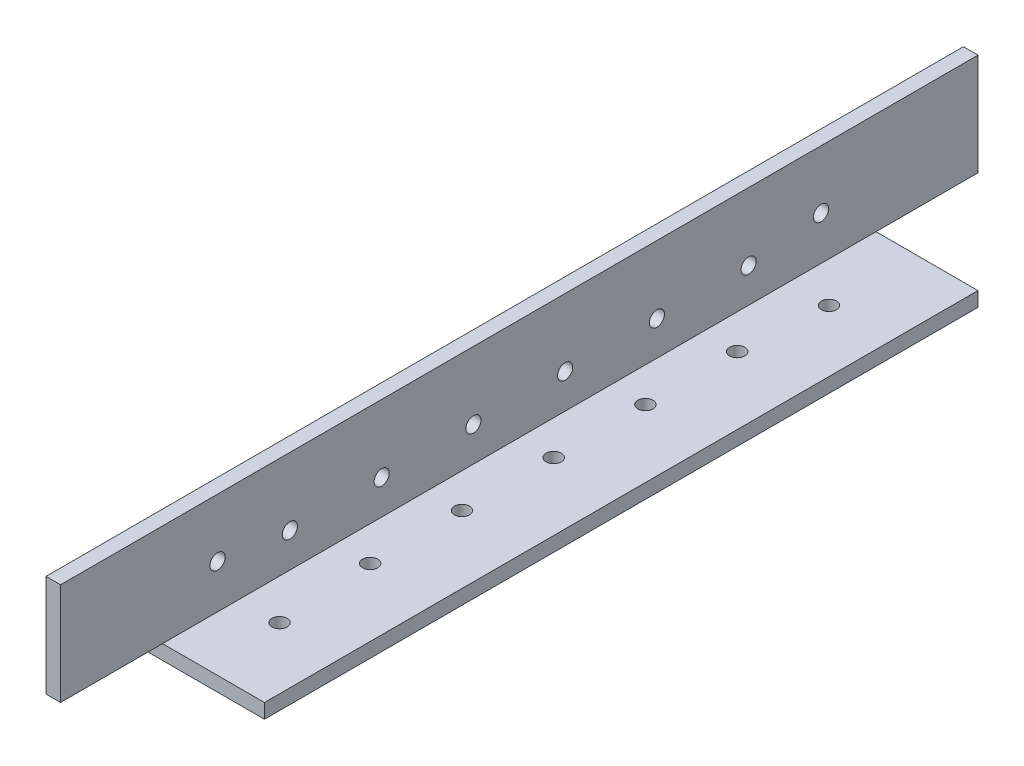
ISO-10303-21;
HEADER;
FILE_DESCRIPTION(('STEP AP214'),'2;1');
FILE_NAME('part.step','',(''),(''),'','','');
FILE_SCHEMA(('AUTOMOTIVE_DESIGN { 1 0 10303 214 1 1 1 1 }'));
ENDSEC;
DATA;
#1=APPLICATION_CONTEXT('core data for automotive mechanical design processes');
#2=APPLICATION_PROTOCOL_DEFINITION('international standard','automotive_design',2000,#1);
#3=PRODUCT_CONTEXT('',#1,'mechanical');
#4=PRODUCT('Part','Part','',(#3));
#5=PRODUCT_RELATED_PRODUCT_CATEGORY('part','',(#4));
#6=PRODUCT_DEFINITION_FORMATION('','',#4);
#7=PRODUCT_DEFINITION_CONTEXT('part definition',#1,'design');
#8=PRODUCT_DEFINITION('design','',#6,#7);
#9=PRODUCT_DEFINITION_SHAPE('','',#8);
#10=(LENGTH_UNIT() NAMED_UNIT(*) SI_UNIT(.MILLI.,.METRE.));
#11=(NAMED_UNIT(*) PLANE_ANGLE_UNIT() SI_UNIT($,.RADIAN.));
#12=(NAMED_UNIT(*) SI_UNIT($,.STERADIAN.) SOLID_ANGLE_UNIT());
#13=UNCERTAINTY_MEASURE_WITH_UNIT(LENGTH_MEASURE(1.E-05),#10,'distance_accuracy_value','');
#14=(GEOMETRIC_REPRESENTATION_CONTEXT(3) GLOBAL_UNCERTAINTY_ASSIGNED_CONTEXT((#13)) GLOBAL_UNIT_ASSIGNED_CONTEXT((#10,
#11,#12)) REPRESENTATION_CONTEXT('',''));
#15=CARTESIAN_POINT('',(0.,0.,0.));
#16=DIRECTION('',(0.,0.,1.));
#17=DIRECTION('',(1.,0.,0.));
#18=AXIS2_PLACEMENT_3D('',#15,#16,#17);
#19=CARTESIAN_POINT('',(0.,0.,1219.2));
#20=DIRECTION('',(0.,0.,1.));
#21=DIRECTION('',(1.,0.,0.));
#22=AXIS2_PLACEMENT_3D('',#19,#20,#21);
#23=PLANE('',#22);
#24=DIRECTION('',(1.,0.,0.));
#25=VECTOR('',#24,1.);
#26=CARTESIAN_POINT('',(25.4,3.175,1219.2));
#27=LINE('',#26,#25);
#28=CARTESIAN_POINT('',(0.,3.175,1219.2));
#29=VERTEX_POINT('',#28);
#30=CARTESIAN_POINT('',(3.175,3.175,1219.2));
#31=VERTEX_POINT('',#30);
#32=EDGE_CURVE('E226',#29,#31,#27,.T.);
#33=ORIENTED_EDGE('',*,*,#32,.T.);
#34=DIRECTION('',(0.,1.,0.));
#35=VECTOR('',#34,1.);
#36=CARTESIAN_POINT('',(3.175,3.175,1219.2));
#37=LINE('',#36,#35);
#38=CARTESIAN_POINT('',(3.175,25.4,1219.2));
#39=VERTEX_POINT('',#38);
#40=EDGE_CURVE('E57',#31,#39,#37,.T.);
#41=ORIENTED_EDGE('',*,*,#40,.T.);
#42=DIRECTION('',(-1.,0.,0.));
#43=VECTOR('',#42,1.);
#44=CARTESIAN_POINT('',(3.175,25.4,1219.2));
#45=LINE('',#44,#43);
#46=CARTESIAN_POINT('',(0.,25.4,1219.2));
#47=VERTEX_POINT('',#46);
#48=EDGE_CURVE('E252',#39,#47,#45,.T.);
#49=ORIENTED_EDGE('',*,*,#48,.T.);
#50=DIRECTION('',(0.,-1.,0.));
#51=VECTOR('',#50,1.);
#52=CARTESIAN_POINT('',(0.,25.4,1219.2));
#53=LINE('',#52,#51);
#54=EDGE_CURVE('E254',#47,#29,#53,.T.);
#55=ORIENTED_EDGE('',*,*,#54,.T.);
#56=EDGE_LOOP('',(#33,#41,#49,#55));
#57=FACE_BOUND('',#56,.T.);
#58=ADVANCED_FACE('F41',(#57),#23,.T.);
#59=CARTESIAN_POINT('',(60.,25.4,1019.2));
#60=DIRECTION('',(0.,0.,1.));
#61=DIRECTION('',(1.,0.,0.));
#62=AXIS2_PLACEMENT_3D('',#59,#60,#61);
#63=PLANE('',#62);
#64=DIRECTION('',(0.,1.,0.));
#65=VECTOR('',#64,1.);
#66=CARTESIAN_POINT('',(3.175,3.175,1019.2));
#67=LINE('',#66,#65);
#68=CARTESIAN_POINT('',(3.175,3.175,1019.2));
#69=VERTEX_POINT('',#68);
#70=CARTESIAN_POINT('',(3.17500000000002,25.4,1019.2));
#71=VERTEX_POINT('',#70);
#72=EDGE_CURVE('E115',#69,#71,#67,.T.);
#73=ORIENTED_EDGE('',*,*,#72,.F.);
#74=DIRECTION('',(1.,0.,0.));
#75=VECTOR('',#74,1.);
#76=CARTESIAN_POINT('',(60.,3.17500000000001,1019.2));
#77=LINE('',#76,#75);
#78=CARTESIAN_POINT('',(0.,3.175,1019.2));
#79=VERTEX_POINT('',#78);
#80=EDGE_CURVE('E50',#79,#69,#77,.T.);
#81=ORIENTED_EDGE('',*,*,#80,.F.);
#82=DIRECTION('',(0.,1.,0.));
#83=VECTOR('',#82,1.);
#84=CARTESIAN_POINT('',(0.,25.4,1019.2));
#85=LINE('',#84,#83);
#86=CARTESIAN_POINT('',(0.,25.4,1019.2));
#87=VERTEX_POINT('',#86);
#88=EDGE_CURVE('E248',#79,#87,#85,.T.);
#89=ORIENTED_EDGE('',*,*,#88,.T.);
#90=DIRECTION('',(-1.,0.,0.));
#91=VECTOR('',#90,1.);
#92=CARTESIAN_POINT('',(60.,25.4,1019.2));
#93=LINE('',#92,#91);
#94=EDGE_CURVE('E120',#71,#87,#93,.T.);
#95=ORIENTED_EDGE('',*,*,#94,.F.);
#96=EDGE_LOOP('',(#73,#81,#89,#95));
#97=FACE_BOUND('',#96,.T.);
#98=ADVANCED_FACE('F117',(#97),#63,.F.);
#99=CARTESIAN_POINT('',(3.175,3.175,1219.2));
#100=DIRECTION('',(-1.,0.,0.));
#101=DIRECTION('',(0.,-1.,0.));
#102=AXIS2_PLACEMENT_3D('',#99,#100,#101);
#103=PLANE('',#102);
#104=CARTESIAN_POINT('',(3.175,12.6999999999998,1053.42570433294));
#105=DIRECTION('',(1.,0.,0.));
#106=DIRECTION('',(0.,1.,0.));
#107=AXIS2_PLACEMENT_3D('',#104,#105,#106);
#108=CIRCLE('',#107,1.64999999999982);
#109=CARTESIAN_POINT('',(3.175,14.3499999999997,1053.42570433294));
#110=VERTEX_POINT('',#109);
#111=EDGE_CURVE('E157',#110,#110,#108,.T.);
#112=ORIENTED_EDGE('',*,*,#111,.F.);
#113=EDGE_LOOP('',(#112));
#114=FACE_BOUND('',#113,.T.);
#115=CARTESIAN_POINT('',(3.175,12.7000000000007,1184.97929566706));
#116=DIRECTION('',(1.,0.,0.));
#117=DIRECTION('',(0.,1.,0.));
#118=AXIS2_PLACEMENT_3D('',#115,#116,#117);
#119=CIRCLE('',#118,1.64999999999982);
#120=CARTESIAN_POINT('',(3.175,14.3500000000006,1184.97929566706));
#121=VERTEX_POINT('',#120);
#122=EDGE_CURVE('E163',#121,#121,#119,.T.);
#123=ORIENTED_EDGE('',*,*,#122,.F.);
#124=EDGE_LOOP('',(#123));
#125=FACE_BOUND('',#124,.T.);
#126=CARTESIAN_POINT('',(3.175,10.675,1169.2));
#127=DIRECTION('',(1.,0.,0.));
#128=DIRECTION('',(0.,1.,0.));
#129=AXIS2_PLACEMENT_3D('',#126,#127,#128);
#130=CIRCLE('',#129,1.64999999999982);
#131=CARTESIAN_POINT('',(3.175,12.3249999999998,1169.2));
#132=VERTEX_POINT('',#131);
#133=EDGE_CURVE('E142',#132,#132,#130,.T.);
#134=ORIENTED_EDGE('',*,*,#133,.F.);
#135=EDGE_LOOP('',(#134));
#136=FACE_BOUND('',#135,.T.);
#137=CARTESIAN_POINT('',(3.175,10.675,1149.2));
#138=DIRECTION('',(1.,0.,0.));
#139=DIRECTION('',(0.,1.,0.));
#140=AXIS2_PLACEMENT_3D('',#137,#138,#139);
#141=CIRCLE('',#140,1.64999999999982);
#142=CARTESIAN_POINT('',(3.175,12.3249999999998,1149.2));
#143=VERTEX_POINT('',#142);
#144=EDGE_CURVE('E205',#143,#143,#141,.T.);
#145=ORIENTED_EDGE('',*,*,#144,.F.);
#146=EDGE_LOOP('',(#145));
#147=FACE_BOUND('',#146,.T.);
#148=CARTESIAN_POINT('',(3.175,10.675,1129.2));
#149=DIRECTION('',(1.,0.,0.));
#150=DIRECTION('',(0.,1.,0.));
#151=AXIS2_PLACEMENT_3D('',#148,#149,#150);
#152=CIRCLE('',#151,1.64999999999982);
#153=CARTESIAN_POINT('',(3.175,12.3249999999998,1129.2));
#154=VERTEX_POINT('',#153);
#155=EDGE_CURVE('E208',#154,#154,#152,.T.);
#156=ORIENTED_EDGE('',*,*,#155,.F.);
#157=EDGE_LOOP('',(#156));
#158=FACE_BOUND('',#157,.T.);
#159=CARTESIAN_POINT('',(3.175,10.675,1109.2));
#160=DIRECTION('',(1.,0.,0.));
#161=DIRECTION('',(0.,1.,0.));
#162=AXIS2_PLACEMENT_3D('',#159,#160,#161);
#163=CIRCLE('',#162,1.64999999999982);
#164=CARTESIAN_POINT('',(3.175,12.3249999999998,1109.2));
#165=VERTEX_POINT('',#164);
#166=EDGE_CURVE('E211',#165,#165,#163,.T.);
#167=ORIENTED_EDGE('',*,*,#166,.F.);
#168=EDGE_LOOP('',(#167));
#169=FACE_BOUND('',#168,.T.);
#170=CARTESIAN_POINT('',(3.175,10.675,1089.2));
#171=DIRECTION('',(1.,0.,0.));
#172=DIRECTION('',(0.,1.,0.));
#173=AXIS2_PLACEMENT_3D('',#170,#171,#172);
#174=CIRCLE('',#173,1.64999999999982);
#175=CARTESIAN_POINT('',(3.175,12.3249999999998,1089.2));
#176=VERTEX_POINT('',#175);
#177=EDGE_CURVE('E214',#176,#176,#174,.T.);
#178=ORIENTED_EDGE('',*,*,#177,.F.);
#179=EDGE_LOOP('',(#178));
#180=FACE_BOUND('',#179,.T.);
#181=CARTESIAN_POINT('',(3.175,10.675,1069.2));
#182=DIRECTION('',(1.,0.,0.));
#183=DIRECTION('',(0.,1.,0.));
#184=AXIS2_PLACEMENT_3D('',#181,#182,#183);
#185=CIRCLE('',#184,1.64999999999982);
#186=CARTESIAN_POINT('',(3.175,12.3249999999998,1069.2));
#187=VERTEX_POINT('',#186);
#188=EDGE_CURVE('E202',#187,#187,#185,.T.);
#189=ORIENTED_EDGE('',*,*,#188,.F.);
#190=EDGE_LOOP('',(#189));
#191=FACE_BOUND('',#190,.T.);
#192=DIRECTION('',(0.,0.,-1.));
#193=VECTOR('',#192,1.);
#194=CARTESIAN_POINT('',(3.175,25.4,1219.2));
#195=LINE('',#194,#193);
#196=EDGE_CURVE('E132',#39,#71,#195,.T.);
#197=ORIENTED_EDGE('',*,*,#196,.F.);
#198=ORIENTED_EDGE('',*,*,#40,.F.);
#199=DIRECTION('',(0.,0.,-1.));
#200=VECTOR('',#199,1.);
#201=CARTESIAN_POINT('',(3.175,3.175,1219.2));
#202=LINE('',#201,#200);
#203=CARTESIAN_POINT('',(3.175,3.175,1196.97));
#204=VERTEX_POINT('',#203);
#205=EDGE_CURVE('E11',#31,#204,#202,.T.);
#206=ORIENTED_EDGE('',*,*,#205,.T.);
#207=DIRECTION('',(0.,0.,-1.));
#208=VECTOR('',#207,1.);
#209=CARTESIAN_POINT('',(3.175,3.175,1239.2));
#210=LINE('',#209,#208);
#211=CARTESIAN_POINT('',(3.175,3.175,1041.43));
#212=VERTEX_POINT('',#211);
#213=EDGE_CURVE('E127',#204,#212,#210,.T.);
#214=ORIENTED_EDGE('',*,*,#213,.T.);
#215=EDGE_CURVE('E125',#212,#69,#210,.T.);
#216=ORIENTED_EDGE('',*,*,#215,.T.);
#217=ORIENTED_EDGE('',*,*,#72,.T.);
#218=EDGE_LOOP('',(#197,#198,#206,#214,#216,#217));
#219=FACE_BOUND('',#218,.T.);
#220=ADVANCED_FACE('F43',(#114,#125,#136,#147,#158,#169,#180,#191,#219),#103,.F.);
#221=CARTESIAN_POINT('',(3.175,25.4,1219.2));
#222=DIRECTION('',(0.,-1.,0.));
#223=DIRECTION('',(1.,0.,0.));
#224=AXIS2_PLACEMENT_3D('',#221,#222,#223);
#225=PLANE('',#224);
#226=ORIENTED_EDGE('',*,*,#196,.T.);
#227=ORIENTED_EDGE('',*,*,#94,.T.);
#228=DIRECTION('',(0.,0.,-1.));
#229=VECTOR('',#228,1.);
#230=CARTESIAN_POINT('',(0.,25.4,1219.2));
#231=LINE('',#230,#229);
#232=EDGE_CURVE('E134',#47,#87,#231,.T.);
#233=ORIENTED_EDGE('',*,*,#232,.F.);
#234=ORIENTED_EDGE('',*,*,#48,.F.);
#235=EDGE_LOOP('',(#226,#227,#233,#234));
#236=FACE_BOUND('',#235,.T.);
#237=ADVANCED_FACE('F271',(#236),#225,.F.);
#238=CARTESIAN_POINT('',(0.,25.4,1219.2));
#239=DIRECTION('',(1.,0.,0.));
#240=DIRECTION('',(0.,1.,0.));
#241=AXIS2_PLACEMENT_3D('',#238,#239,#240);
#242=PLANE('',#241);
#243=CARTESIAN_POINT('',(0.,12.6999999999998,1053.42570433294));
#244=DIRECTION('',(1.,0.,0.));
#245=DIRECTION('',(0.,1.,0.));
#246=AXIS2_PLACEMENT_3D('',#243,#244,#245);
#247=CIRCLE('',#246,1.64999999999982);
#248=CARTESIAN_POINT('',(0.,14.3499999999997,1053.42570433294));
#249=VERTEX_POINT('',#248);
#250=EDGE_CURVE('E45',#249,#249,#247,.T.);
#251=ORIENTED_EDGE('',*,*,#250,.T.);
#252=EDGE_LOOP('',(#251));
#253=FACE_BOUND('',#252,.T.);
#254=CARTESIAN_POINT('',(0.,12.7000000000007,1184.97929566706));
#255=DIRECTION('',(1.,0.,0.));
#256=DIRECTION('',(0.,1.,0.));
#257=AXIS2_PLACEMENT_3D('',#254,#255,#256);
#258=CIRCLE('',#257,1.64999999999982);
#259=CARTESIAN_POINT('',(0.,14.3500000000006,1184.97929566706));
#260=VERTEX_POINT('',#259);
#261=EDGE_CURVE('E155',#260,#260,#258,.T.);
#262=ORIENTED_EDGE('',*,*,#261,.T.);
#263=EDGE_LOOP('',(#262));
#264=FACE_BOUND('',#263,.T.);
#265=CARTESIAN_POINT('',(0.,10.675,1169.2));
#266=DIRECTION('',(1.,0.,0.));
#267=DIRECTION('',(0.,1.,0.));
#268=AXIS2_PLACEMENT_3D('',#265,#266,#267);
#269=CIRCLE('',#268,1.64999999999982);
#270=CARTESIAN_POINT('',(0.,12.3249999999998,1169.2));
#271=VERTEX_POINT('',#270);
#272=EDGE_CURVE('E129',#271,#271,#269,.T.);
#273=ORIENTED_EDGE('',*,*,#272,.T.);
#274=EDGE_LOOP('',(#273));
#275=FACE_BOUND('',#274,.T.);
#276=CARTESIAN_POINT('',(0.,10.675,1149.2));
#277=DIRECTION('',(1.,0.,0.));
#278=DIRECTION('',(0.,1.,0.));
#279=AXIS2_PLACEMENT_3D('',#276,#277,#278);
#280=CIRCLE('',#279,1.64999999999982);
#281=CARTESIAN_POINT('',(0.,12.3249999999998,1149.2));
#282=VERTEX_POINT('',#281);
#283=EDGE_CURVE('E151',#282,#282,#280,.T.);
#284=ORIENTED_EDGE('',*,*,#283,.T.);
#285=EDGE_LOOP('',(#284));
#286=FACE_BOUND('',#285,.T.);
#287=CARTESIAN_POINT('',(0.,10.675,1129.2));
#288=DIRECTION('',(1.,0.,0.));
#289=DIRECTION('',(0.,1.,0.));
#290=AXIS2_PLACEMENT_3D('',#287,#288,#289);
#291=CIRCLE('',#290,1.64999999999982);
#292=CARTESIAN_POINT('',(0.,12.3249999999998,1129.2));
#293=VERTEX_POINT('',#292);
#294=EDGE_CURVE('E148',#293,#293,#291,.T.);
#295=ORIENTED_EDGE('',*,*,#294,.T.);
#296=EDGE_LOOP('',(#295));
#297=FACE_BOUND('',#296,.T.);
#298=CARTESIAN_POINT('',(0.,10.675,1109.2));
#299=DIRECTION('',(1.,0.,0.));
#300=DIRECTION('',(0.,1.,0.));
#301=AXIS2_PLACEMENT_3D('',#298,#299,#300);
#302=CIRCLE('',#301,1.64999999999982);
#303=CARTESIAN_POINT('',(0.,12.3249999999998,1109.2));
#304=VERTEX_POINT('',#303);
#305=EDGE_CURVE('E145',#304,#304,#302,.T.);
#306=ORIENTED_EDGE('',*,*,#305,.T.);
#307=EDGE_LOOP('',(#306));
#308=FACE_BOUND('',#307,.T.);
#309=CARTESIAN_POINT('',(0.,10.675,1089.2));
#310=DIRECTION('',(1.,0.,0.));
#311=DIRECTION('',(0.,1.,0.));
#312=AXIS2_PLACEMENT_3D('',#309,#310,#311);
#313=CIRCLE('',#312,1.64999999999982);
#314=CARTESIAN_POINT('',(0.,12.3249999999998,1089.2));
#315=VERTEX_POINT('',#314);
#316=EDGE_CURVE('E141',#315,#315,#313,.T.);
#317=ORIENTED_EDGE('',*,*,#316,.T.);
#318=EDGE_LOOP('',(#317));
#319=FACE_BOUND('',#318,.T.);
#320=CARTESIAN_POINT('',(0.,10.675,1069.2));
#321=DIRECTION('',(1.,0.,0.));
#322=DIRECTION('',(0.,1.,0.));
#323=AXIS2_PLACEMENT_3D('',#320,#321,#322);
#324=CIRCLE('',#323,1.64999999999982);
#325=CARTESIAN_POINT('',(0.,12.3249999999998,1069.2));
#326=VERTEX_POINT('',#325);
#327=EDGE_CURVE('E138',#326,#326,#324,.T.);
#328=ORIENTED_EDGE('',*,*,#327,.T.);
#329=EDGE_LOOP('',(#328));
#330=FACE_BOUND('',#329,.T.);
#331=DIRECTION('',(0.,0.,-1.));
#332=VECTOR('',#331,1.);
#333=CARTESIAN_POINT('',(0.,0.,1219.2));
#334=LINE('',#333,#332);
#335=CARTESIAN_POINT('',(0.,0.,1196.97));
#336=VERTEX_POINT('',#335);
#337=CARTESIAN_POINT('',(0.,0.,1041.43));
#338=VERTEX_POINT('',#337);
#339=EDGE_CURVE('E262',#336,#338,#334,.T.);
#340=ORIENTED_EDGE('',*,*,#339,.F.);
#341=DIRECTION('',(0.,-1.,0.));
#342=VECTOR('',#341,1.);
#343=CARTESIAN_POINT('',(0.,36.9290056882142,1196.97));
#344=LINE('',#343,#342);
#345=CARTESIAN_POINT('',(0.,3.175,1196.97));
#346=VERTEX_POINT('',#345);
#347=EDGE_CURVE('E229',#346,#336,#344,.T.);
#348=ORIENTED_EDGE('',*,*,#347,.F.);
#349=DIRECTION('',(0.,0.,1.));
#350=VECTOR('',#349,1.);
#351=CARTESIAN_POINT('',(0.,3.175,1219.2));
#352=LINE('',#351,#350);
#353=EDGE_CURVE('E219',#346,#29,#352,.T.);
#354=ORIENTED_EDGE('',*,*,#353,.T.);
#355=ORIENTED_EDGE('',*,*,#54,.F.);
#356=ORIENTED_EDGE('',*,*,#232,.T.);
#357=ORIENTED_EDGE('',*,*,#88,.F.);
#358=DIRECTION('',(0.,0.,1.));
#359=VECTOR('',#358,1.);
#360=CARTESIAN_POINT('',(0.,3.175,1019.2));
#361=LINE('',#360,#359);
#362=CARTESIAN_POINT('',(0.,3.175,1041.43));
#363=VERTEX_POINT('',#362);
#364=EDGE_CURVE('E65',#79,#363,#361,.T.);
#365=ORIENTED_EDGE('',*,*,#364,.T.);
#366=DIRECTION('',(0.,-1.,0.));
#367=VECTOR('',#366,1.);
#368=CARTESIAN_POINT('',(0.,36.9290056882142,1041.43));
#369=LINE('',#368,#367);
#370=EDGE_CURVE('E238',#363,#338,#369,.T.);
#371=ORIENTED_EDGE('',*,*,#370,.T.);
#372=EDGE_LOOP('',(#340,#348,#354,#355,#356,#357,#365,#371));
#373=FACE_BOUND('',#372,.T.);
#374=ADVANCED_FACE('F268',(#253,#264,#275,#286,#297,#308,#319,#330,#373),#242,.F.);
#375=CARTESIAN_POINT('',(0.,0.,1219.2));
#376=DIRECTION('',(0.,1.,0.));
#377=DIRECTION('',(0.,0.,1.));
#378=AXIS2_PLACEMENT_3D('',#375,#376,#377);
#379=PLANE('',#378);
#380=CARTESIAN_POINT('',(11.9634000000024,0.,1180.26062285682));
#381=DIRECTION('',(0.,1.,0.));
#382=DIRECTION('',(0.,0.,1.));
#383=AXIS2_PLACEMENT_3D('',#380,#381,#382);
#384=CIRCLE('',#383,1.65000000000001);
#385=CARTESIAN_POINT('',(11.9634000000024,0.,1181.91062285682));
#386=VERTEX_POINT('',#385);
#387=EDGE_CURVE('E168',#386,#386,#384,.T.);
#388=ORIENTED_EDGE('',*,*,#387,.T.);
#389=EDGE_LOOP('',(#388));
#390=FACE_BOUND('',#389,.T.);
#391=CARTESIAN_POINT('',(11.9634000000002,0.,1060.48));
#392=DIRECTION('',(0.,1.,0.));
#393=DIRECTION('',(0.,0.,1.));
#394=AXIS2_PLACEMENT_3D('',#391,#392,#393);
#395=CIRCLE('',#394,1.65);
#396=CARTESIAN_POINT('',(11.9634000000002,0.,1062.13));
#397=VERTEX_POINT('',#396);
#398=EDGE_CURVE('E385',#397,#397,#395,.T.);
#399=ORIENTED_EDGE('',*,*,#398,.T.);
#400=EDGE_LOOP('',(#399));
#401=FACE_BOUND('',#400,.T.);
#402=CARTESIAN_POINT('',(10.675,0.,1079.2));
#403=DIRECTION('',(0.,1.,0.));
#404=DIRECTION('',(0.,0.,1.));
#405=AXIS2_PLACEMENT_3D('',#402,#403,#404);
#406=CIRCLE('',#405,1.65000000000001);
#407=CARTESIAN_POINT('',(10.675,0.,1080.85));
#408=VERTEX_POINT('',#407);
#409=EDGE_CURVE('E199',#408,#408,#406,.T.);
#410=ORIENTED_EDGE('',*,*,#409,.T.);
#411=EDGE_LOOP('',(#410));
#412=FACE_BOUND('',#411,.T.);
#413=CARTESIAN_POINT('',(10.6750000000002,0.,1099.2));
#414=DIRECTION('',(0.,1.,0.));
#415=DIRECTION('',(0.,0.,1.));
#416=AXIS2_PLACEMENT_3D('',#413,#414,#415);
#417=CIRCLE('',#416,1.65000000000001);
#418=CARTESIAN_POINT('',(10.6750000000002,0.,1100.85));
#419=VERTEX_POINT('',#418);
#420=EDGE_CURVE('E196',#419,#419,#417,.T.);
#421=ORIENTED_EDGE('',*,*,#420,.T.);
#422=EDGE_LOOP('',(#421));
#423=FACE_BOUND('',#422,.T.);
#424=CARTESIAN_POINT('',(10.6750000000004,0.,1119.2));
#425=DIRECTION('',(0.,1.,0.));
#426=DIRECTION('',(0.,0.,1.));
#427=AXIS2_PLACEMENT_3D('',#424,#425,#426);
#428=CIRCLE('',#427,1.65000000000001);
#429=CARTESIAN_POINT('',(10.6750000000004,0.,1120.85));
#430=VERTEX_POINT('',#429);
#431=EDGE_CURVE('E193',#430,#430,#428,.T.);
#432=ORIENTED_EDGE('',*,*,#431,.T.);
#433=EDGE_LOOP('',(#432));
#434=FACE_BOUND('',#433,.T.);
#435=CARTESIAN_POINT('',(10.6750000000006,0.,1139.2));
#436=DIRECTION('',(0.,1.,0.));
#437=DIRECTION('',(0.,0.,1.));
#438=AXIS2_PLACEMENT_3D('',#435,#436,#437);
#439=CIRCLE('',#438,1.65000000000001);
#440=CARTESIAN_POINT('',(10.6750000000006,0.,1140.85));
#441=VERTEX_POINT('',#440);
#442=EDGE_CURVE('E190',#441,#441,#439,.T.);
#443=ORIENTED_EDGE('',*,*,#442,.T.);
#444=EDGE_LOOP('',(#443));
#445=FACE_BOUND('',#444,.T.);
#446=CARTESIAN_POINT('',(10.6750000000008,0.,1159.2));
#447=DIRECTION('',(0.,1.,0.));
#448=DIRECTION('',(0.,0.,1.));
#449=AXIS2_PLACEMENT_3D('',#446,#447,#448);
#450=CIRCLE('',#449,1.65000000000001);
#451=CARTESIAN_POINT('',(10.6750000000008,0.,1160.85));
#452=VERTEX_POINT('',#451);
#453=EDGE_CURVE('E176',#452,#452,#450,.T.);
#454=ORIENTED_EDGE('',*,*,#453,.T.);
#455=EDGE_LOOP('',(#454));
#456=FACE_BOUND('',#455,.T.);
#457=DIRECTION('',(0.,0.,-1.));
#458=VECTOR('',#457,1.);
#459=CARTESIAN_POINT('',(25.4,0.,1219.2));
#460=LINE('',#459,#458);
#461=CARTESIAN_POINT('',(25.4,0.,1196.97));
#462=VERTEX_POINT('',#461);
#463=CARTESIAN_POINT('',(25.4,0.,1041.43));
#464=VERTEX_POINT('',#463);
#465=EDGE_CURVE('E260',#462,#464,#460,.T.);
#466=ORIENTED_EDGE('',*,*,#465,.F.);
#467=DIRECTION('',(1.,0.,0.));
#468=VECTOR('',#467,1.);
#469=CARTESIAN_POINT('',(25.4,0.,1196.97));
#470=LINE('',#469,#468);
#471=EDGE_CURVE('E227',#336,#462,#470,.T.);
#472=ORIENTED_EDGE('',*,*,#471,.F.);
#473=ORIENTED_EDGE('',*,*,#339,.T.);
#474=DIRECTION('',(-1.,0.,0.));
#475=VECTOR('',#474,1.);
#476=CARTESIAN_POINT('',(25.4,0.,1041.43));
#477=LINE('',#476,#475);
#478=EDGE_CURVE('E235',#464,#338,#477,.T.);
#479=ORIENTED_EDGE('',*,*,#478,.F.);
#480=EDGE_LOOP('',(#466,#472,#473,#479));
#481=FACE_BOUND('',#480,.T.);
#482=ADVANCED_FACE('F283',(#390,#401,#412,#423,#434,#445,#456,#481),#379,.F.);
#483=CARTESIAN_POINT('',(25.4,0.,1219.2));
#484=DIRECTION('',(-1.,0.,0.));
#485=DIRECTION('',(0.,0.,1.));
#486=AXIS2_PLACEMENT_3D('',#483,#484,#485);
#487=PLANE('',#486);
#488=DIRECTION('',(0.,0.,-1.));
#489=VECTOR('',#488,1.);
#490=CARTESIAN_POINT('',(25.4,3.175,1219.2));
#491=LINE('',#490,#489);
#492=CARTESIAN_POINT('',(25.4,3.175,1196.97));
#493=VERTEX_POINT('',#492);
#494=CARTESIAN_POINT('',(25.4,3.175,1041.43));
#495=VERTEX_POINT('',#494);
#496=EDGE_CURVE('E257',#493,#495,#491,.T.);
#497=ORIENTED_EDGE('',*,*,#496,.F.);
#498=DIRECTION('',(0.,-1.,0.));
#499=VECTOR('',#498,1.);
#500=CARTESIAN_POINT('',(25.4,36.9290056882142,1196.97));
#501=LINE('',#500,#499);
#502=EDGE_CURVE('E223',#493,#462,#501,.T.);
#503=ORIENTED_EDGE('',*,*,#502,.T.);
#504=ORIENTED_EDGE('',*,*,#465,.T.);
#505=DIRECTION('',(0.,-1.,0.));
#506=VECTOR('',#505,1.);
#507=CARTESIAN_POINT('',(25.4,36.9290056882142,1041.43));
#508=LINE('',#507,#506);
#509=EDGE_CURVE('E241',#495,#464,#508,.T.);
#510=ORIENTED_EDGE('',*,*,#509,.F.);
#511=EDGE_LOOP('',(#497,#503,#504,#510));
#512=FACE_BOUND('',#511,.T.);
#513=ADVANCED_FACE('F288',(#512),#487,.F.);
#514=CARTESIAN_POINT('',(25.4,3.175,1219.2));
#515=DIRECTION('',(0.,-1.,0.));
#516=DIRECTION('',(1.,0.,0.));
#517=AXIS2_PLACEMENT_3D('',#514,#515,#516);
#518=PLANE('',#517);
#519=CARTESIAN_POINT('',(11.9634000000024,3.175,1180.26062285682));
#520=DIRECTION('',(0.,1.,0.));
#521=DIRECTION('',(-1.,0.,0.));
#522=AXIS2_PLACEMENT_3D('',#519,#520,#521);
#523=CIRCLE('',#522,1.65000000000001);
#524=CARTESIAN_POINT('',(10.3134000000024,3.175,1180.26062285682));
#525=VERTEX_POINT('',#524);
#526=EDGE_CURVE('E381',#525,#525,#523,.T.);
#527=ORIENTED_EDGE('',*,*,#526,.F.);
#528=EDGE_LOOP('',(#527));
#529=FACE_BOUND('',#528,.T.);
#530=CARTESIAN_POINT('',(11.9634000000002,3.175,1060.48));
#531=DIRECTION('',(0.,1.,0.));
#532=DIRECTION('',(-1.,0.,0.));
#533=AXIS2_PLACEMENT_3D('',#530,#531,#532);
#534=CIRCLE('',#533,1.65);
#535=CARTESIAN_POINT('',(10.3134000000002,3.175,1060.48));
#536=VERTEX_POINT('',#535);
#537=EDGE_CURVE('E389',#536,#536,#534,.T.);
#538=ORIENTED_EDGE('',*,*,#537,.F.);
#539=EDGE_LOOP('',(#538));
#540=FACE_BOUND('',#539,.T.);
#541=CARTESIAN_POINT('',(10.675,3.175,1079.2));
#542=DIRECTION('',(0.,1.,0.));
#543=DIRECTION('',(-1.,0.,0.));
#544=AXIS2_PLACEMENT_3D('',#541,#542,#543);
#545=CIRCLE('',#544,1.65000000000001);
#546=CARTESIAN_POINT('',(9.02499999999999,3.175,1079.2));
#547=VERTEX_POINT('',#546);
#548=EDGE_CURVE('E173',#547,#547,#545,.T.);
#549=ORIENTED_EDGE('',*,*,#548,.F.);
#550=EDGE_LOOP('',(#549));
#551=FACE_BOUND('',#550,.T.);
#552=CARTESIAN_POINT('',(10.6750000000002,3.175,1099.2));
#553=DIRECTION('',(0.,1.,0.));
#554=DIRECTION('',(-1.,0.,0.));
#555=AXIS2_PLACEMENT_3D('',#552,#553,#554);
#556=CIRCLE('',#555,1.65000000000001);
#557=CARTESIAN_POINT('',(9.0250000000002,3.175,1099.2));
#558=VERTEX_POINT('',#557);
#559=EDGE_CURVE('E177',#558,#558,#556,.T.);
#560=ORIENTED_EDGE('',*,*,#559,.F.);
#561=EDGE_LOOP('',(#560));
#562=FACE_BOUND('',#561,.T.);
#563=CARTESIAN_POINT('',(10.6750000000004,3.175,1119.2));
#564=DIRECTION('',(0.,1.,0.));
#565=DIRECTION('',(-1.,0.,0.));
#566=AXIS2_PLACEMENT_3D('',#563,#564,#565);
#567=CIRCLE('',#566,1.65000000000001);
#568=CARTESIAN_POINT('',(9.02500000000041,3.175,1119.2));
#569=VERTEX_POINT('',#568);
#570=EDGE_CURVE('E180',#569,#569,#567,.T.);
#571=ORIENTED_EDGE('',*,*,#570,.F.);
#572=EDGE_LOOP('',(#571));
#573=FACE_BOUND('',#572,.T.);
#574=CARTESIAN_POINT('',(10.6750000000006,3.175,1139.2));
#575=DIRECTION('',(0.,1.,0.));
#576=DIRECTION('',(-1.,0.,0.));
#577=AXIS2_PLACEMENT_3D('',#574,#575,#576);
#578=CIRCLE('',#577,1.65000000000001);
#579=CARTESIAN_POINT('',(9.02500000000062,3.175,1139.2));
#580=VERTEX_POINT('',#579);
#581=EDGE_CURVE('E183',#580,#580,#578,.T.);
#582=ORIENTED_EDGE('',*,*,#581,.F.);
#583=EDGE_LOOP('',(#582));
#584=FACE_BOUND('',#583,.T.);
#585=CARTESIAN_POINT('',(10.6750000000008,3.175,1159.2));
#586=DIRECTION('',(0.,1.,0.));
#587=DIRECTION('',(-1.,0.,0.));
#588=AXIS2_PLACEMENT_3D('',#585,#586,#587);
#589=CIRCLE('',#588,1.65000000000001);
#590=CARTESIAN_POINT('',(9.02500000000083,3.175,1159.2));
#591=VERTEX_POINT('',#590);
#592=EDGE_CURVE('E161',#591,#591,#589,.T.);
#593=ORIENTED_EDGE('',*,*,#592,.F.);
#594=EDGE_LOOP('',(#593));
#595=FACE_BOUND('',#594,.T.);
#596=ORIENTED_EDGE('',*,*,#496,.T.);
#597=DIRECTION('',(1.,0.,0.));
#598=VECTOR('',#597,1.);
#599=CARTESIAN_POINT('',(25.4,3.175,1041.43));
#600=LINE('',#599,#598);
#601=EDGE_CURVE('E237',#212,#495,#600,.T.);
#602=ORIENTED_EDGE('',*,*,#601,.F.);
#603=ORIENTED_EDGE('',*,*,#213,.F.);
#604=DIRECTION('',(-1.,0.,0.));
#605=VECTOR('',#604,1.);
#606=CARTESIAN_POINT('',(25.4,3.175,1196.97));
#607=LINE('',#606,#605);
#608=EDGE_CURVE('E224',#493,#204,#607,.T.);
#609=ORIENTED_EDGE('',*,*,#608,.F.);
#610=EDGE_LOOP('',(#596,#602,#603,#609));
#611=FACE_BOUND('',#610,.T.);
#612=ADVANCED_FACE('F293',(#529,#540,#551,#562,#573,#584,#595,#611),#518,.F.);
#613=CARTESIAN_POINT('',(25.4,36.9290056882142,1041.43));
#614=DIRECTION('',(0.,0.,1.));
#615=DIRECTION('',(1.,0.,0.));
#616=AXIS2_PLACEMENT_3D('',#613,#614,#615);
#617=PLANE('',#616);
#618=EDGE_CURVE('E246',#363,#212,#600,.T.);
#619=ORIENTED_EDGE('',*,*,#618,.T.);
#620=ORIENTED_EDGE('',*,*,#601,.T.);
#621=ORIENTED_EDGE('',*,*,#509,.T.);
#622=ORIENTED_EDGE('',*,*,#478,.T.);
#623=ORIENTED_EDGE('',*,*,#370,.F.);
#624=EDGE_LOOP('',(#619,#620,#621,#622,#623));
#625=FACE_BOUND('',#624,.T.);
#626=ADVANCED_FACE('F290',(#625),#617,.F.);
#627=CARTESIAN_POINT('',(25.4,3.175,1219.2));
#628=DIRECTION('',(0.,-1.,0.));
#629=DIRECTION('',(1.,0.,0.));
#630=AXIS2_PLACEMENT_3D('',#627,#628,#629);
#631=PLANE('',#630);
#632=ORIENTED_EDGE('',*,*,#215,.F.);
#633=ORIENTED_EDGE('',*,*,#618,.F.);
#634=ORIENTED_EDGE('',*,*,#364,.F.);
#635=ORIENTED_EDGE('',*,*,#80,.T.);
#636=EDGE_LOOP('',(#632,#633,#634,#635));
#637=FACE_BOUND('',#636,.T.);
#638=ADVANCED_FACE('F131',(#637),#631,.T.);
#639=CARTESIAN_POINT('',(25.4,36.9290056882142,1196.97));
#640=DIRECTION('',(0.,0.,-1.));
#641=DIRECTION('',(-1.,0.,0.));
#642=AXIS2_PLACEMENT_3D('',#639,#640,#641);
#643=PLANE('',#642);
#644=ORIENTED_EDGE('',*,*,#608,.T.);
#645=EDGE_CURVE('E222',#204,#346,#607,.T.);
#646=ORIENTED_EDGE('',*,*,#645,.T.);
#647=ORIENTED_EDGE('',*,*,#347,.T.);
#648=ORIENTED_EDGE('',*,*,#471,.T.);
#649=ORIENTED_EDGE('',*,*,#502,.F.);
#650=EDGE_LOOP('',(#644,#646,#647,#648,#649));
#651=FACE_BOUND('',#650,.T.);
#652=ADVANCED_FACE('F280',(#651),#643,.F.);
#653=CARTESIAN_POINT('',(25.4,3.175,1219.2));
#654=DIRECTION('',(0.,-1.,0.));
#655=DIRECTION('',(1.,0.,0.));
#656=AXIS2_PLACEMENT_3D('',#653,#654,#655);
#657=PLANE('',#656);
#658=ORIENTED_EDGE('',*,*,#205,.F.);
#659=ORIENTED_EDGE('',*,*,#32,.F.);
#660=ORIENTED_EDGE('',*,*,#353,.F.);
#661=ORIENTED_EDGE('',*,*,#645,.F.);
#662=EDGE_LOOP('',(#658,#659,#660,#661));
#663=FACE_BOUND('',#662,.T.);
#664=ADVANCED_FACE('F275',(#663),#657,.T.);
#665=CARTESIAN_POINT('',(-16.825,10.675,1069.2));
#666=DIRECTION('',(1.,0.,0.));
#667=DIRECTION('',(0.,1.,0.));
#668=AXIS2_PLACEMENT_3D('',#665,#666,#667);
#669=CYLINDRICAL_SURFACE('',#668,1.64999999999982);
#670=ORIENTED_EDGE('',*,*,#188,.T.);
#671=EDGE_LOOP('',(#670));
#672=FACE_BOUND('',#671,.T.);
#673=ORIENTED_EDGE('',*,*,#327,.F.);
#674=EDGE_LOOP('',(#673));
#675=FACE_BOUND('',#674,.T.);
#676=ADVANCED_FACE('F320',(#672,#675),#669,.F.);
#677=CARTESIAN_POINT('',(-16.825,10.675,1089.2));
#678=DIRECTION('',(1.,0.,0.));
#679=DIRECTION('',(0.,1.,0.));
#680=AXIS2_PLACEMENT_3D('',#677,#678,#679);
#681=CYLINDRICAL_SURFACE('',#680,1.64999999999982);
#682=ORIENTED_EDGE('',*,*,#177,.T.);
#683=EDGE_LOOP('',(#682));
#684=FACE_BOUND('',#683,.T.);
#685=ORIENTED_EDGE('',*,*,#316,.F.);
#686=EDGE_LOOP('',(#685));
#687=FACE_BOUND('',#686,.T.);
#688=ADVANCED_FACE('F323',(#684,#687),#681,.F.);
#689=CARTESIAN_POINT('',(-16.825,10.675,1109.2));
#690=DIRECTION('',(1.,0.,0.));
#691=DIRECTION('',(0.,1.,0.));
#692=AXIS2_PLACEMENT_3D('',#689,#690,#691);
#693=CYLINDRICAL_SURFACE('',#692,1.64999999999982);
#694=ORIENTED_EDGE('',*,*,#166,.T.);
#695=EDGE_LOOP('',(#694));
#696=FACE_BOUND('',#695,.T.);
#697=ORIENTED_EDGE('',*,*,#305,.F.);
#698=EDGE_LOOP('',(#697));
#699=FACE_BOUND('',#698,.T.);
#700=ADVANCED_FACE('F327',(#696,#699),#693,.F.);
#701=CARTESIAN_POINT('',(-16.825,10.675,1129.2));
#702=DIRECTION('',(1.,0.,0.));
#703=DIRECTION('',(0.,1.,0.));
#704=AXIS2_PLACEMENT_3D('',#701,#702,#703);
#705=CYLINDRICAL_SURFACE('',#704,1.64999999999982);
#706=ORIENTED_EDGE('',*,*,#155,.T.);
#707=EDGE_LOOP('',(#706));
#708=FACE_BOUND('',#707,.T.);
#709=ORIENTED_EDGE('',*,*,#294,.F.);
#710=EDGE_LOOP('',(#709));
#711=FACE_BOUND('',#710,.T.);
#712=ADVANCED_FACE('F331',(#708,#711),#705,.F.);
#713=CARTESIAN_POINT('',(-16.825,10.675,1149.2));
#714=DIRECTION('',(1.,0.,0.));
#715=DIRECTION('',(0.,1.,0.));
#716=AXIS2_PLACEMENT_3D('',#713,#714,#715);
#717=CYLINDRICAL_SURFACE('',#716,1.64999999999982);
#718=ORIENTED_EDGE('',*,*,#144,.T.);
#719=EDGE_LOOP('',(#718));
#720=FACE_BOUND('',#719,.T.);
#721=ORIENTED_EDGE('',*,*,#283,.F.);
#722=EDGE_LOOP('',(#721));
#723=FACE_BOUND('',#722,.T.);
#724=ADVANCED_FACE('F335',(#720,#723),#717,.F.);
#725=CARTESIAN_POINT('',(-16.825,10.675,1169.2));
#726=DIRECTION('',(1.,0.,0.));
#727=DIRECTION('',(0.,1.,0.));
#728=AXIS2_PLACEMENT_3D('',#725,#726,#727);
#729=CYLINDRICAL_SURFACE('',#728,1.64999999999982);
#730=ORIENTED_EDGE('',*,*,#133,.T.);
#731=EDGE_LOOP('',(#730));
#732=FACE_BOUND('',#731,.T.);
#733=ORIENTED_EDGE('',*,*,#272,.F.);
#734=EDGE_LOOP('',(#733));
#735=FACE_BOUND('',#734,.T.);
#736=ADVANCED_FACE('F339',(#732,#735),#729,.F.);
#737=CARTESIAN_POINT('',(10.6750000000008,-16.825,1159.2));
#738=DIRECTION('',(0.,1.,0.));
#739=DIRECTION('',(-1.,0.,0.));
#740=AXIS2_PLACEMENT_3D('',#737,#738,#739);
#741=CYLINDRICAL_SURFACE('',#740,1.65000000000001);
#742=ORIENTED_EDGE('',*,*,#592,.T.);
#743=EDGE_LOOP('',(#742));
#744=FACE_BOUND('',#743,.T.);
#745=ORIENTED_EDGE('',*,*,#453,.F.);
#746=EDGE_LOOP('',(#745));
#747=FACE_BOUND('',#746,.T.);
#748=ADVANCED_FACE('F343',(#744,#747),#741,.F.);
#749=CARTESIAN_POINT('',(10.6750000000006,-16.825,1139.2));
#750=DIRECTION('',(0.,1.,0.));
#751=DIRECTION('',(-1.,0.,0.));
#752=AXIS2_PLACEMENT_3D('',#749,#750,#751);
#753=CYLINDRICAL_SURFACE('',#752,1.65000000000001);
#754=ORIENTED_EDGE('',*,*,#581,.T.);
#755=EDGE_LOOP('',(#754));
#756=FACE_BOUND('',#755,.T.);
#757=ORIENTED_EDGE('',*,*,#442,.F.);
#758=EDGE_LOOP('',(#757));
#759=FACE_BOUND('',#758,.T.);
#760=ADVANCED_FACE('F347',(#756,#759),#753,.F.);
#761=CARTESIAN_POINT('',(10.6750000000004,-16.825,1119.2));
#762=DIRECTION('',(0.,1.,0.));
#763=DIRECTION('',(-1.,0.,0.));
#764=AXIS2_PLACEMENT_3D('',#761,#762,#763);
#765=CYLINDRICAL_SURFACE('',#764,1.65000000000001);
#766=ORIENTED_EDGE('',*,*,#570,.T.);
#767=EDGE_LOOP('',(#766));
#768=FACE_BOUND('',#767,.T.);
#769=ORIENTED_EDGE('',*,*,#431,.F.);
#770=EDGE_LOOP('',(#769));
#771=FACE_BOUND('',#770,.T.);
#772=ADVANCED_FACE('F351',(#768,#771),#765,.F.);
#773=CARTESIAN_POINT('',(10.6750000000002,-16.825,1099.2));
#774=DIRECTION('',(0.,1.,0.));
#775=DIRECTION('',(-1.,0.,0.));
#776=AXIS2_PLACEMENT_3D('',#773,#774,#775);
#777=CYLINDRICAL_SURFACE('',#776,1.65000000000001);
#778=ORIENTED_EDGE('',*,*,#559,.T.);
#779=EDGE_LOOP('',(#778));
#780=FACE_BOUND('',#779,.T.);
#781=ORIENTED_EDGE('',*,*,#420,.F.);
#782=EDGE_LOOP('',(#781));
#783=FACE_BOUND('',#782,.T.);
#784=ADVANCED_FACE('F355',(#780,#783),#777,.F.);
#785=CARTESIAN_POINT('',(10.675,-16.825,1079.2));
#786=DIRECTION('',(0.,1.,0.));
#787=DIRECTION('',(-1.,0.,0.));
#788=AXIS2_PLACEMENT_3D('',#785,#786,#787);
#789=CYLINDRICAL_SURFACE('',#788,1.65000000000001);
#790=ORIENTED_EDGE('',*,*,#548,.T.);
#791=EDGE_LOOP('',(#790));
#792=FACE_BOUND('',#791,.T.);
#793=ORIENTED_EDGE('',*,*,#409,.F.);
#794=EDGE_LOOP('',(#793));
#795=FACE_BOUND('',#794,.T.);
#796=ADVANCED_FACE('F359',(#792,#795),#789,.F.);
#797=CARTESIAN_POINT('',(-66.825,12.7000000000007,1184.97929566706));
#798=DIRECTION('',(1.,0.,0.));
#799=DIRECTION('',(0.,1.,0.));
#800=AXIS2_PLACEMENT_3D('',#797,#798,#799);
#801=CYLINDRICAL_SURFACE('',#800,1.64999999999982);
#802=ORIENTED_EDGE('',*,*,#122,.T.);
#803=EDGE_LOOP('',(#802));
#804=FACE_BOUND('',#803,.T.);
#805=ORIENTED_EDGE('',*,*,#261,.F.);
#806=EDGE_LOOP('',(#805));
#807=FACE_BOUND('',#806,.T.);
#808=ADVANCED_FACE('F363',(#804,#807),#801,.F.);
#809=CARTESIAN_POINT('',(-66.825,12.6999999999998,1053.42570433294));
#810=DIRECTION('',(1.,0.,0.));
#811=DIRECTION('',(0.,1.,0.));
#812=AXIS2_PLACEMENT_3D('',#809,#810,#811);
#813=CYLINDRICAL_SURFACE('',#812,1.64999999999982);
#814=ORIENTED_EDGE('',*,*,#111,.T.);
#815=EDGE_LOOP('',(#814));
#816=FACE_BOUND('',#815,.T.);
#817=ORIENTED_EDGE('',*,*,#250,.F.);
#818=EDGE_LOOP('',(#817));
#819=FACE_BOUND('',#818,.T.);
#820=ADVANCED_FACE('F367',(#816,#819),#813,.F.);
#821=CARTESIAN_POINT('',(11.9634000000002,-66.825,1060.48));
#822=DIRECTION('',(0.,1.,0.));
#823=DIRECTION('',(-1.,0.,0.));
#824=AXIS2_PLACEMENT_3D('',#821,#822,#823);
#825=CYLINDRICAL_SURFACE('',#824,1.65);
#826=ORIENTED_EDGE('',*,*,#537,.T.);
#827=EDGE_LOOP('',(#826));
#828=FACE_BOUND('',#827,.T.);
#829=ORIENTED_EDGE('',*,*,#398,.F.);
#830=EDGE_LOOP('',(#829));
#831=FACE_BOUND('',#830,.T.);
#832=ADVANCED_FACE('F371',(#828,#831),#825,.F.);
#833=CARTESIAN_POINT('',(11.9634000000024,-66.825,1180.26062285682));
#834=DIRECTION('',(0.,1.,0.));
#835=DIRECTION('',(-1.,0.,0.));
#836=AXIS2_PLACEMENT_3D('',#833,#834,#835);
#837=CYLINDRICAL_SURFACE('',#836,1.65000000000001);
#838=ORIENTED_EDGE('',*,*,#526,.T.);
#839=EDGE_LOOP('',(#838));
#840=FACE_BOUND('',#839,.T.);
#841=ORIENTED_EDGE('',*,*,#387,.F.);
#842=EDGE_LOOP('',(#841));
#843=FACE_BOUND('',#842,.T.);
#844=ADVANCED_FACE('F373',(#840,#843),#837,.F.);
#845=CLOSED_SHELL('',(#58,#98,#220,#237,#374,#482,#513,#612,#626,#638,#652,#664,#676,#688,#700,
#712,#724,#736,#748,#760,#772,#784,#796,#808,#820,#832,#844));
#846=MANIFOLD_SOLID_BREP('B2',#845);
#847=ADVANCED_BREP_SHAPE_REPRESENTATION('',(#18,#846),#14);
#848=SHAPE_DEFINITION_REPRESENTATION(#9,#847);
ENDSEC;
END-ISO-10303-21;
